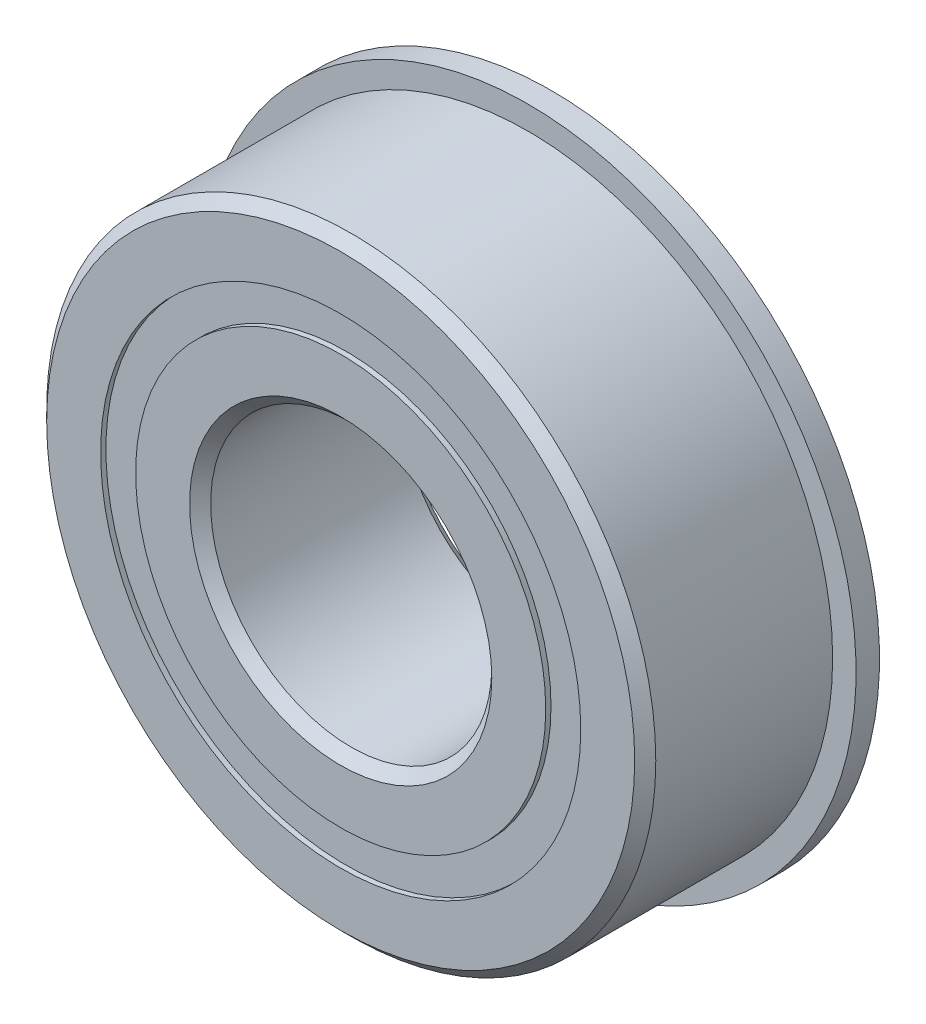
ISO-10303-21;
HEADER;
FILE_DESCRIPTION(('STEP AP214'),'2;1');
FILE_NAME('part.step','',(''),(''),'','','');
FILE_SCHEMA(('AUTOMOTIVE_DESIGN { 1 0 10303 214 1 1 1 1 }'));
ENDSEC;
DATA;
#1=APPLICATION_CONTEXT('core data for automotive mechanical design processes');
#2=APPLICATION_PROTOCOL_DEFINITION('international standard','automotive_design',2000,#1);
#3=PRODUCT_CONTEXT('',#1,'mechanical');
#4=PRODUCT('Part','Part','',(#3));
#5=PRODUCT_RELATED_PRODUCT_CATEGORY('part','',(#4));
#6=PRODUCT_DEFINITION_FORMATION('','',#4);
#7=PRODUCT_DEFINITION_CONTEXT('part definition',#1,'design');
#8=PRODUCT_DEFINITION('design','',#6,#7);
#9=PRODUCT_DEFINITION_SHAPE('','',#8);
#10=(LENGTH_UNIT() NAMED_UNIT(*) SI_UNIT(.MILLI.,.METRE.));
#11=(NAMED_UNIT(*) PLANE_ANGLE_UNIT() SI_UNIT($,.RADIAN.));
#12=(NAMED_UNIT(*) SI_UNIT($,.STERADIAN.) SOLID_ANGLE_UNIT());
#13=UNCERTAINTY_MEASURE_WITH_UNIT(LENGTH_MEASURE(1.E-05),#10,'distance_accuracy_value','');
#14=(GEOMETRIC_REPRESENTATION_CONTEXT(3) GLOBAL_UNCERTAINTY_ASSIGNED_CONTEXT((#13)) GLOBAL_UNIT_ASSIGNED_CONTEXT((#10,
#11,#12)) REPRESENTATION_CONTEXT('',''));
#15=CARTESIAN_POINT('',(0.,0.,0.));
#16=DIRECTION('',(0.,0.,1.));
#17=DIRECTION('',(1.,0.,0.));
#18=AXIS2_PLACEMENT_3D('',#15,#16,#17);
#19=CARTESIAN_POINT('',(0.,16.2675137362637,-6.7865625));
#20=DIRECTION('',(0.,0.,1.));
#21=DIRECTION('',(1.,0.,0.));
#22=AXIS2_PLACEMENT_3D('',#19,#20,#21);
#23=PLANE('',#22);
#24=CARTESIAN_POINT('',(0.,0.,-6.7865625));
#25=DIRECTION('',(0.,0.,1.));
#26=DIRECTION('',(1.,0.,0.));
#27=AXIS2_PLACEMENT_3D('',#24,#25,#26);
#28=CIRCLE('',#27,16.2675137362637);
#29=CARTESIAN_POINT('',(16.2675137362637,0.,-6.7865625));
#30=VERTEX_POINT('',#29);
#31=EDGE_CURVE('E59',#30,#30,#28,.T.);
#32=ORIENTED_EDGE('',*,*,#31,.F.);
#33=EDGE_LOOP('',(#32));
#34=FACE_BOUND('',#33,.T.);
#35=CARTESIAN_POINT('',(0.,0.,-6.7865625));
#36=DIRECTION('',(0.,0.,1.));
#37=DIRECTION('',(1.,0.,0.));
#38=AXIS2_PLACEMENT_3D('',#35,#36,#37);
#39=CIRCLE('',#38,13.8949862637363);
#40=CARTESIAN_POINT('',(13.8949862637363,0.,-6.7865625));
#41=VERTEX_POINT('',#40);
#42=EDGE_CURVE('E11',#41,#41,#39,.T.);
#43=ORIENTED_EDGE('',*,*,#42,.T.);
#44=EDGE_LOOP('',(#43));
#45=FACE_BOUND('',#44,.T.);
#46=ADVANCED_FACE('F45',(#34,#45),#23,.F.);
#47=CARTESIAN_POINT('',(0.,0.,7.14375));
#48=DIRECTION('',(0.,0.,1.));
#49=DIRECTION('',(1.,0.,0.));
#50=AXIS2_PLACEMENT_3D('',#47,#48,#49);
#51=CYLINDRICAL_SURFACE('',#50,13.8949862637363);
#52=ORIENTED_EDGE('',*,*,#42,.F.);
#53=EDGE_LOOP('',(#52));
#54=FACE_BOUND('',#53,.T.);
#55=CARTESIAN_POINT('',(0.,0.,-3.38937260447629));
#56=DIRECTION('',(0.,0.,1.));
#57=DIRECTION('',(1.,0.,0.));
#58=AXIS2_PLACEMENT_3D('',#55,#56,#57);
#59=CIRCLE('',#58,13.8949862637363);
#60=CARTESIAN_POINT('',(13.8949862637363,0.,-3.38937260447629));
#61=VERTEX_POINT('',#60);
#62=EDGE_CURVE('E51',#61,#61,#59,.T.);
#63=ORIENTED_EDGE('',*,*,#62,.T.);
#64=EDGE_LOOP('',(#63));
#65=FACE_BOUND('',#64,.T.);
#66=ADVANCED_FACE('F68',(#54,#65),#51,.F.);
#67=CARTESIAN_POINT('',(0.,16.2675137362637,-3.38937260447629));
#68=DIRECTION('',(0.,0.,-1.));
#69=DIRECTION('',(-1.,0.,0.));
#70=AXIS2_PLACEMENT_3D('',#67,#68,#69);
#71=PLANE('',#70);
#72=ORIENTED_EDGE('',*,*,#62,.F.);
#73=EDGE_LOOP('',(#72));
#74=FACE_BOUND('',#73,.T.);
#75=CARTESIAN_POINT('',(0.,0.,-3.38937260447629));
#76=DIRECTION('',(0.,0.,1.));
#77=DIRECTION('',(1.,0.,0.));
#78=AXIS2_PLACEMENT_3D('',#75,#76,#77);
#79=CIRCLE('',#78,16.2675137362637);
#80=CARTESIAN_POINT('',(16.2675137362637,0.,-3.38937260447629));
#81=VERTEX_POINT('',#80);
#82=EDGE_CURVE('E55',#81,#81,#79,.T.);
#83=ORIENTED_EDGE('',*,*,#82,.T.);
#84=EDGE_LOOP('',(#83));
#85=FACE_BOUND('',#84,.T.);
#86=ADVANCED_FACE('F72',(#74,#85),#71,.F.);
#87=CARTESIAN_POINT('',(0.,0.,7.14375));
#88=DIRECTION('',(0.,0.,1.));
#89=DIRECTION('',(1.,0.,0.));
#90=AXIS2_PLACEMENT_3D('',#87,#88,#89);
#91=CYLINDRICAL_SURFACE('',#90,16.2675137362637);
#92=ORIENTED_EDGE('',*,*,#82,.F.);
#93=EDGE_LOOP('',(#92));
#94=FACE_BOUND('',#93,.T.);
#95=ORIENTED_EDGE('',*,*,#31,.T.);
#96=EDGE_LOOP('',(#95));
#97=FACE_BOUND('',#96,.T.);
#98=ADVANCED_FACE('F65',(#94,#97),#91,.T.);
#99=CLOSED_SHELL('',(#46,#66,#86,#98));
#100=MANIFOLD_SOLID_BREP('B2',#99);
#101=CARTESIAN_POINT('',(0.,16.2675137362637,6.7865625));
#102=DIRECTION('',(0.,0.,-1.));
#103=DIRECTION('',(-1.,0.,0.));
#104=AXIS2_PLACEMENT_3D('',#101,#102,#103);
#105=PLANE('',#104);
#106=CARTESIAN_POINT('',(0.,0.,6.7865625));
#107=DIRECTION('',(0.,0.,1.));
#108=DIRECTION('',(1.,0.,0.));
#109=AXIS2_PLACEMENT_3D('',#106,#107,#108);
#110=CIRCLE('',#109,13.8949862637363);
#111=CARTESIAN_POINT('',(13.8949862637363,0.,6.7865625));
#112=VERTEX_POINT('',#111);
#113=EDGE_CURVE('E44',#112,#112,#110,.T.);
#114=ORIENTED_EDGE('',*,*,#113,.F.);
#115=EDGE_LOOP('',(#114));
#116=FACE_BOUND('',#115,.T.);
#117=CARTESIAN_POINT('',(0.,0.,6.7865625));
#118=DIRECTION('',(0.,0.,1.));
#119=DIRECTION('',(1.,0.,0.));
#120=AXIS2_PLACEMENT_3D('',#117,#118,#119);
#121=CIRCLE('',#120,16.2675137362637);
#122=CARTESIAN_POINT('',(16.2675137362637,0.,6.7865625));
#123=VERTEX_POINT('',#122);
#124=EDGE_CURVE('E126',#123,#123,#121,.T.);
#125=ORIENTED_EDGE('',*,*,#124,.T.);
#126=EDGE_LOOP('',(#125));
#127=FACE_BOUND('',#126,.T.);
#128=ADVANCED_FACE('F112',(#116,#127),#105,.F.);
#129=CARTESIAN_POINT('',(0.,0.,7.14375));
#130=DIRECTION('',(0.,0.,1.));
#131=DIRECTION('',(1.,0.,0.));
#132=AXIS2_PLACEMENT_3D('',#129,#130,#131);
#133=CYLINDRICAL_SURFACE('',#132,13.8949862637363);
#134=CARTESIAN_POINT('',(0.,0.,3.38937260447629));
#135=DIRECTION('',(0.,0.,1.));
#136=DIRECTION('',(1.,0.,0.));
#137=AXIS2_PLACEMENT_3D('',#134,#135,#136);
#138=CIRCLE('',#137,13.8949862637363);
#139=CARTESIAN_POINT('',(13.8949862637363,0.,3.38937260447629));
#140=VERTEX_POINT('',#139);
#141=EDGE_CURVE('E118',#140,#140,#138,.T.);
#142=ORIENTED_EDGE('',*,*,#141,.F.);
#143=EDGE_LOOP('',(#142));
#144=FACE_BOUND('',#143,.T.);
#145=ORIENTED_EDGE('',*,*,#113,.T.);
#146=EDGE_LOOP('',(#145));
#147=FACE_BOUND('',#146,.T.);
#148=ADVANCED_FACE('F141',(#144,#147),#133,.F.);
#149=CARTESIAN_POINT('',(0.,16.2675137362637,3.38937260447629));
#150=DIRECTION('',(0.,0.,1.));
#151=DIRECTION('',(1.,0.,0.));
#152=AXIS2_PLACEMENT_3D('',#149,#150,#151);
#153=PLANE('',#152);
#154=CARTESIAN_POINT('',(0.,0.,3.38937260447629));
#155=DIRECTION('',(0.,0.,1.));
#156=DIRECTION('',(1.,0.,0.));
#157=AXIS2_PLACEMENT_3D('',#154,#155,#156);
#158=CIRCLE('',#157,16.2675137362637);
#159=CARTESIAN_POINT('',(16.2675137362637,0.,3.38937260447629));
#160=VERTEX_POINT('',#159);
#161=EDGE_CURVE('E122',#160,#160,#158,.T.);
#162=ORIENTED_EDGE('',*,*,#161,.F.);
#163=EDGE_LOOP('',(#162));
#164=FACE_BOUND('',#163,.T.);
#165=ORIENTED_EDGE('',*,*,#141,.T.);
#166=EDGE_LOOP('',(#165));
#167=FACE_BOUND('',#166,.T.);
#168=ADVANCED_FACE('F136',(#164,#167),#153,.F.);
#169=CARTESIAN_POINT('',(0.,0.,7.14375));
#170=DIRECTION('',(0.,0.,1.));
#171=DIRECTION('',(1.,0.,0.));
#172=AXIS2_PLACEMENT_3D('',#169,#170,#171);
#173=CYLINDRICAL_SURFACE('',#172,16.2675137362637);
#174=ORIENTED_EDGE('',*,*,#124,.F.);
#175=EDGE_LOOP('',(#174));
#176=FACE_BOUND('',#175,.T.);
#177=ORIENTED_EDGE('',*,*,#161,.T.);
#178=EDGE_LOOP('',(#177));
#179=FACE_BOUND('',#178,.T.);
#180=ADVANCED_FACE('F133',(#176,#179),#173,.T.);
#181=CLOSED_SHELL('',(#128,#148,#168,#180));
#182=MANIFOLD_SOLID_BREP('B6',#181);
#183=CARTESIAN_POINT('',(-6.5435091405665,13.5877367390534,0.));
#184=DIRECTION('',(0.,0.,1.));
#185=DIRECTION('',(-0.433883739117546,0.900968867902425,0.));
#186=AXIS2_PLACEMENT_3D('',#183,#184,#185);
#187=SPHERICAL_SURFACE('',#186,3.38937260447629);
#188=CARTESIAN_POINT('',(-6.5435091405665,13.5877367390534,3.38937260447629));
#189=VERTEX_POINT('',#188);
#190=VERTEX_LOOP('',#189);
#191=FACE_BOUND('',#190,.T.);
#192=ADVANCED_FACE('F179',(#191),#187,.T.);
#193=CLOSED_SHELL('',(#192));
#194=MANIFOLD_SOLID_BREP('B39',#193);
#195=CARTESIAN_POINT('',(-11.7909960449709,9.40300557428217,0.));
#196=DIRECTION('',(0.,0.,1.));
#197=DIRECTION('',(-0.781831482468022,0.623489801858743,0.));
#198=AXIS2_PLACEMENT_3D('',#195,#196,#197);
#199=SPHERICAL_SURFACE('',#198,3.38937260447629);
#200=CARTESIAN_POINT('',(-11.7909960449709,9.40300557428217,3.38937260447629));
#201=VERTEX_POINT('',#200);
#202=VERTEX_LOOP('',#201);
#203=FACE_BOUND('',#202,.T.);
#204=ADVANCED_FACE('F199',(#203),#199,.T.);
#205=CLOSED_SHELL('',(#204));
#206=MANIFOLD_SOLID_BREP('B108',#205);
#207=CARTESIAN_POINT('',(-14.7031315755921,3.35589383522882,0.));
#208=DIRECTION('',(0.,0.,1.));
#209=DIRECTION('',(-0.974927912181821,0.222520933956325,0.));
#210=AXIS2_PLACEMENT_3D('',#207,#208,#209);
#211=SPHERICAL_SURFACE('',#210,3.38937260447629);
#212=CARTESIAN_POINT('',(-14.7031315755921,3.35589383522882,3.38937260447629));
#213=VERTEX_POINT('',#212);
#214=VERTEX_LOOP('',#213);
#215=FACE_BOUND('',#214,.T.);
#216=ADVANCED_FACE('F219',(#215),#211,.T.);
#217=CLOSED_SHELL('',(#216));
#218=MANIFOLD_SOLID_BREP('B175',#217);
#219=CARTESIAN_POINT('',(-14.7031315755922,-3.35589383522853,0.));
#220=DIRECTION('',(0.,0.,1.));
#221=DIRECTION('',(-0.974927912181826,-0.222520933956305,0.));
#222=AXIS2_PLACEMENT_3D('',#219,#220,#221);
#223=SPHERICAL_SURFACE('',#222,3.38937260447629);
#224=CARTESIAN_POINT('',(-14.7031315755922,-3.35589383522853,3.38937260447629));
#225=VERTEX_POINT('',#224);
#226=VERTEX_LOOP('',#225);
#227=FACE_BOUND('',#226,.T.);
#228=ADVANCED_FACE('F239',(#227),#223,.T.);
#229=CLOSED_SHELL('',(#228));
#230=MANIFOLD_SOLID_BREP('B195',#229);
#231=CARTESIAN_POINT('',(-11.7909960449711,-9.40300557428192,0.));
#232=DIRECTION('',(0.,0.,1.));
#233=DIRECTION('',(-0.781831482468035,-0.623489801858727,0.));
#234=AXIS2_PLACEMENT_3D('',#231,#232,#233);
#235=SPHERICAL_SURFACE('',#234,3.38937260447629);
#236=CARTESIAN_POINT('',(-11.7909960449711,-9.40300557428192,3.38937260447629));
#237=VERTEX_POINT('',#236);
#238=VERTEX_LOOP('',#237);
#239=FACE_BOUND('',#238,.T.);
#240=ADVANCED_FACE('F259',(#239),#235,.T.);
#241=CLOSED_SHELL('',(#240));
#242=MANIFOLD_SOLID_BREP('B215',#241);
#243=CARTESIAN_POINT('',(-6.54350914056678,-13.5877367390533,0.));
#244=DIRECTION('',(0.,0.,1.));
#245=DIRECTION('',(-0.433883739117565,-0.900968867902416,0.));
#246=AXIS2_PLACEMENT_3D('',#243,#244,#245);
#247=SPHERICAL_SURFACE('',#246,3.38937260447629);
#248=CARTESIAN_POINT('',(-6.54350914056678,-13.5877367390533,3.38937260447629));
#249=VERTEX_POINT('',#248);
#250=VERTEX_LOOP('',#249);
#251=FACE_BOUND('',#250,.T.);
#252=ADVANCED_FACE('F279',(#251),#247,.T.);
#253=CLOSED_SHELL('',(#252));
#254=MANIFOLD_SOLID_BREP('B235',#253);
#255=CARTESIAN_POINT('',(-1.05311805882856E-13,-15.08125,0.));
#256=DIRECTION('',(0.,0.,1.));
#257=DIRECTION('',(0.,-1.,0.));
#258=AXIS2_PLACEMENT_3D('',#255,#256,#257);
#259=SPHERICAL_SURFACE('',#258,3.38937260447629);
#260=CARTESIAN_POINT('',(-1.05311805882856E-13,-15.08125,3.38937260447629));
#261=VERTEX_POINT('',#260);
#262=VERTEX_LOOP('',#261);
#263=FACE_BOUND('',#262,.T.);
#264=ADVANCED_FACE('F299',(#263),#259,.T.);
#265=CLOSED_SHELL('',(#264));
#266=MANIFOLD_SOLID_BREP('B255',#265);
#267=CARTESIAN_POINT('',(6.54350914056659,-13.5877367390534,0.));
#268=DIRECTION('',(0.,0.,1.));
#269=DIRECTION('',(0.433883739117553,-0.900968867902422,0.));
#270=AXIS2_PLACEMENT_3D('',#267,#268,#269);
#271=SPHERICAL_SURFACE('',#270,3.38937260447629);
#272=CARTESIAN_POINT('',(6.54350914056659,-13.5877367390534,3.38937260447629));
#273=VERTEX_POINT('',#272);
#274=VERTEX_LOOP('',#273);
#275=FACE_BOUND('',#274,.T.);
#276=ADVANCED_FACE('F319',(#275),#271,.T.);
#277=CLOSED_SHELL('',(#276));
#278=MANIFOLD_SOLID_BREP('B275',#277);
#279=CARTESIAN_POINT('',(11.7909960449709,-9.40300557428208,0.));
#280=DIRECTION('',(0.,0.,1.));
#281=DIRECTION('',(0.781831482468027,-0.623489801858737,0.));
#282=AXIS2_PLACEMENT_3D('',#279,#280,#281);
#283=SPHERICAL_SURFACE('',#282,3.38937260447629);
#284=CARTESIAN_POINT('',(11.7909960449709,-9.40300557428208,3.38937260447629));
#285=VERTEX_POINT('',#284);
#286=VERTEX_LOOP('',#285);
#287=FACE_BOUND('',#286,.T.);
#288=ADVANCED_FACE('F339',(#287),#283,.T.);
#289=CLOSED_SHELL('',(#288));
#290=MANIFOLD_SOLID_BREP('B295',#289);
#291=CARTESIAN_POINT('',(14.7031315755921,-3.35589383522872,0.));
#292=DIRECTION('',(0.,0.,1.));
#293=DIRECTION('',(0.974927912181823,-0.222520933956318,0.));
#294=AXIS2_PLACEMENT_3D('',#291,#292,#293);
#295=SPHERICAL_SURFACE('',#294,3.38937260447629);
#296=CARTESIAN_POINT('',(14.7031315755921,-3.35589383522872,3.38937260447629));
#297=VERTEX_POINT('',#296);
#298=VERTEX_LOOP('',#297);
#299=FACE_BOUND('',#298,.T.);
#300=ADVANCED_FACE('F359',(#299),#295,.T.);
#301=CLOSED_SHELL('',(#300));
#302=MANIFOLD_SOLID_BREP('B315',#301);
#303=CARTESIAN_POINT('',(14.7031315755921,3.35589383522862,0.));
#304=DIRECTION('',(0.,0.,1.));
#305=DIRECTION('',(0.974927912181824,0.222520933956311,0.));
#306=AXIS2_PLACEMENT_3D('',#303,#304,#305);
#307=SPHERICAL_SURFACE('',#306,3.38937260447629);
#308=CARTESIAN_POINT('',(14.7031315755921,3.35589383522862,3.38937260447629));
#309=VERTEX_POINT('',#308);
#310=VERTEX_LOOP('',#309);
#311=FACE_BOUND('',#310,.T.);
#312=ADVANCED_FACE('F379',(#311),#307,.T.);
#313=CLOSED_SHELL('',(#312));
#314=MANIFOLD_SOLID_BREP('B335',#313);
#315=CARTESIAN_POINT('',(11.790996044971,9.403005574282,0.));
#316=DIRECTION('',(0.,0.,1.));
#317=DIRECTION('',(0.781831482468031,0.623489801858732,0.));
#318=AXIS2_PLACEMENT_3D('',#315,#316,#317);
#319=SPHERICAL_SURFACE('',#318,3.38937260447629);
#320=CARTESIAN_POINT('',(11.790996044971,9.403005574282,3.38937260447629));
#321=VERTEX_POINT('',#320);
#322=VERTEX_LOOP('',#321);
#323=FACE_BOUND('',#322,.T.);
#324=ADVANCED_FACE('F399',(#323),#319,.T.);
#325=CLOSED_SHELL('',(#324));
#326=MANIFOLD_SOLID_BREP('B355',#325);
#327=CARTESIAN_POINT('',(6.54350914056669,13.5877367390534,0.));
#328=DIRECTION('',(0.,0.,1.));
#329=DIRECTION('',(0.433883739117559,0.900968867902419,0.));
#330=AXIS2_PLACEMENT_3D('',#327,#328,#329);
#331=SPHERICAL_SURFACE('',#330,3.38937260447629);
#332=CARTESIAN_POINT('',(6.54350914056669,13.5877367390534,3.38937260447629));
#333=VERTEX_POINT('',#332);
#334=VERTEX_LOOP('',#333);
#335=FACE_BOUND('',#334,.T.);
#336=ADVANCED_FACE('F419',(#335),#331,.T.);
#337=CLOSED_SHELL('',(#336));
#338=MANIFOLD_SOLID_BREP('B375',#337);
#339=CARTESIAN_POINT('',(0.,15.08125,0.));
#340=DIRECTION('',(0.,0.,1.));
#341=DIRECTION('',(0.,1.,0.));
#342=AXIS2_PLACEMENT_3D('',#339,#340,#341);
#343=SPHERICAL_SURFACE('',#342,3.38937260447629);
#344=CARTESIAN_POINT('',(0.,15.08125,3.38937260447629));
#345=VERTEX_POINT('',#344);
#346=VERTEX_LOOP('',#345);
#347=FACE_BOUND('',#346,.T.);
#348=ADVANCED_FACE('F441',(#347),#343,.T.);
#349=CLOSED_SHELL('',(#348));
#350=MANIFOLD_SOLID_BREP('B395',#349);
#351=CARTESIAN_POINT('',(0.,13.8949862637363,7.14375));
#352=DIRECTION('',(0.,0.,-1.));
#353=DIRECTION('',(-1.,0.,0.));
#354=AXIS2_PLACEMENT_3D('',#351,#352,#353);
#355=PLANE('',#354);
#356=CARTESIAN_POINT('',(0.,0.,7.14375));
#357=DIRECTION('',(0.,0.,1.));
#358=DIRECTION('',(1.,0.,0.));
#359=AXIS2_PLACEMENT_3D('',#356,#357,#358);
#360=CIRCLE('',#359,10.239375);
#361=CARTESIAN_POINT('',(10.239375,0.,7.14375));
#362=VERTEX_POINT('',#361);
#363=EDGE_CURVE('E488',#362,#362,#360,.T.);
#364=ORIENTED_EDGE('',*,*,#363,.F.);
#365=EDGE_LOOP('',(#364));
#366=FACE_BOUND('',#365,.T.);
#367=CARTESIAN_POINT('',(0.,0.,7.14375));
#368=DIRECTION('',(0.,0.,1.));
#369=DIRECTION('',(1.,0.,0.));
#370=AXIS2_PLACEMENT_3D('',#367,#368,#369);
#371=CIRCLE('',#370,13.8949862637363);
#372=CARTESIAN_POINT('',(13.8949862637363,0.,7.14375));
#373=VERTEX_POINT('',#372);
#374=EDGE_CURVE('E440',#373,#373,#371,.T.);
#375=ORIENTED_EDGE('',*,*,#374,.T.);
#376=EDGE_LOOP('',(#375));
#377=FACE_BOUND('',#376,.T.);
#378=ADVANCED_FACE('F460',(#366,#377),#355,.F.);
#379=CARTESIAN_POINT('',(0.,0.,7.14375));
#380=DIRECTION('',(0.,0.,1.));
#381=DIRECTION('',(1.,0.,0.));
#382=AXIS2_PLACEMENT_3D('',#379,#380,#381);
#383=CYLINDRICAL_SURFACE('',#382,13.8949862637363);
#384=ORIENTED_EDGE('',*,*,#374,.F.);
#385=EDGE_LOOP('',(#384));
#386=FACE_BOUND('',#385,.T.);
#387=CARTESIAN_POINT('',(0.,0.,3.175));
#388=DIRECTION('',(0.,0.,1.));
#389=DIRECTION('',(1.,0.,0.));
#390=AXIS2_PLACEMENT_3D('',#387,#388,#389);
#391=CIRCLE('',#390,13.8949862637363);
#392=CARTESIAN_POINT('',(13.8949862637363,0.,3.175));
#393=VERTEX_POINT('',#392);
#394=EDGE_CURVE('E466',#393,#393,#391,.T.);
#395=ORIENTED_EDGE('',*,*,#394,.T.);
#396=EDGE_LOOP('',(#395));
#397=FACE_BOUND('',#396,.T.);
#398=ADVANCED_FACE('F495',(#386,#397),#383,.T.);
#399=CARTESIAN_POINT('',(0.,0.,0.));
#400=DIRECTION('',(0.,0.,1.));
#401=DIRECTION('',(1.,0.,0.));
#402=AXIS2_PLACEMENT_3D('',#399,#400,#401);
#403=TOROIDAL_SURFACE('',#402,15.08125,3.38937260447629);
#404=ORIENTED_EDGE('',*,*,#394,.F.);
#405=EDGE_LOOP('',(#404));
#406=FACE_BOUND('',#405,.T.);
#407=CARTESIAN_POINT('',(0.,0.,-3.175));
#408=DIRECTION('',(0.,0.,1.));
#409=DIRECTION('',(1.,0.,0.));
#410=AXIS2_PLACEMENT_3D('',#407,#408,#409);
#411=CIRCLE('',#410,13.8949862637363);
#412=CARTESIAN_POINT('',(13.8949862637363,0.,-3.175));
#413=VERTEX_POINT('',#412);
#414=EDGE_CURVE('E470',#413,#413,#411,.T.);
#415=ORIENTED_EDGE('',*,*,#414,.T.);
#416=EDGE_LOOP('',(#415));
#417=FACE_BOUND('',#416,.T.);
#418=ADVANCED_FACE('F499',(#406,#417),#403,.F.);
#419=CARTESIAN_POINT('',(0.,0.,7.14375));
#420=DIRECTION('',(0.,0.,1.));
#421=DIRECTION('',(1.,0.,0.));
#422=AXIS2_PLACEMENT_3D('',#419,#420,#421);
#423=CYLINDRICAL_SURFACE('',#422,13.8949862637363);
#424=ORIENTED_EDGE('',*,*,#414,.F.);
#425=EDGE_LOOP('',(#424));
#426=FACE_BOUND('',#425,.T.);
#427=CARTESIAN_POINT('',(0.,0.,-7.14375));
#428=DIRECTION('',(0.,0.,1.));
#429=DIRECTION('',(1.,0.,0.));
#430=AXIS2_PLACEMENT_3D('',#427,#428,#429);
#431=CIRCLE('',#430,13.8949862637363);
#432=CARTESIAN_POINT('',(13.8949862637363,0.,-7.14375));
#433=VERTEX_POINT('',#432);
#434=EDGE_CURVE('E474',#433,#433,#431,.T.);
#435=ORIENTED_EDGE('',*,*,#434,.T.);
#436=EDGE_LOOP('',(#435));
#437=FACE_BOUND('',#436,.T.);
#438=ADVANCED_FACE('F504',(#426,#437),#423,.T.);
#439=CARTESIAN_POINT('',(0.,10.239375,-7.14375));
#440=DIRECTION('',(0.,0.,1.));
#441=DIRECTION('',(1.,0.,0.));
#442=AXIS2_PLACEMENT_3D('',#439,#440,#441);
#443=PLANE('',#442);
#444=ORIENTED_EDGE('',*,*,#434,.F.);
#445=EDGE_LOOP('',(#444));
#446=FACE_BOUND('',#445,.T.);
#447=CARTESIAN_POINT('',(0.,0.,-7.14375));
#448=DIRECTION('',(0.,0.,1.));
#449=DIRECTION('',(1.,0.,0.));
#450=AXIS2_PLACEMENT_3D('',#447,#448,#449);
#451=CIRCLE('',#450,10.239375);
#452=CARTESIAN_POINT('',(10.239375,0.,-7.14375));
#453=VERTEX_POINT('',#452);
#454=EDGE_CURVE('E479',#453,#453,#451,.T.);
#455=ORIENTED_EDGE('',*,*,#454,.T.);
#456=EDGE_LOOP('',(#455));
#457=FACE_BOUND('',#456,.T.);
#458=ADVANCED_FACE('F510',(#446,#457),#443,.F.);
#459=CARTESIAN_POINT('',(0.,0.,-6.429375));
#460=DIRECTION('',(0.,0.,-1.));
#461=DIRECTION('',(-1.,0.,0.));
#462=AXIS2_PLACEMENT_3D('',#459,#460,#461);
#463=CONICAL_SURFACE('',#462,9.525,0.785398163397444);
#464=ORIENTED_EDGE('',*,*,#454,.F.);
#465=EDGE_LOOP('',(#464));
#466=FACE_BOUND('',#465,.T.);
#467=CARTESIAN_POINT('',(0.,0.,-6.429375));
#468=DIRECTION('',(0.,0.,1.));
#469=DIRECTION('',(1.,0.,0.));
#470=AXIS2_PLACEMENT_3D('',#467,#468,#469);
#471=CIRCLE('',#470,9.525);
#472=CARTESIAN_POINT('',(9.525,0.,-6.429375));
#473=VERTEX_POINT('',#472);
#474=EDGE_CURVE('E482',#473,#473,#471,.T.);
#475=ORIENTED_EDGE('',*,*,#474,.T.);
#476=EDGE_LOOP('',(#475));
#477=FACE_BOUND('',#476,.T.);
#478=ADVANCED_FACE('F514',(#466,#477),#463,.F.);
#479=CARTESIAN_POINT('',(0.,0.,7.14375));
#480=DIRECTION('',(0.,0.,1.));
#481=DIRECTION('',(1.,0.,0.));
#482=AXIS2_PLACEMENT_3D('',#479,#480,#481);
#483=CYLINDRICAL_SURFACE('',#482,9.525);
#484=ORIENTED_EDGE('',*,*,#474,.F.);
#485=EDGE_LOOP('',(#484));
#486=FACE_BOUND('',#485,.T.);
#487=CARTESIAN_POINT('',(0.,0.,6.429375));
#488=DIRECTION('',(0.,0.,1.));
#489=DIRECTION('',(1.,0.,0.));
#490=AXIS2_PLACEMENT_3D('',#487,#488,#489);
#491=CIRCLE('',#490,9.525);
#492=CARTESIAN_POINT('',(9.525,0.,6.429375));
#493=VERTEX_POINT('',#492);
#494=EDGE_CURVE('E485',#493,#493,#491,.T.);
#495=ORIENTED_EDGE('',*,*,#494,.T.);
#496=EDGE_LOOP('',(#495));
#497=FACE_BOUND('',#496,.T.);
#498=ADVANCED_FACE('F518',(#486,#497),#483,.F.);
#499=CARTESIAN_POINT('',(0.,0.,7.14375));
#500=DIRECTION('',(0.,0.,1.));
#501=DIRECTION('',(1.,0.,0.));
#502=AXIS2_PLACEMENT_3D('',#499,#500,#501);
#503=CONICAL_SURFACE('',#502,10.239375,0.785398163397453);
#504=ORIENTED_EDGE('',*,*,#494,.F.);
#505=EDGE_LOOP('',(#504));
#506=FACE_BOUND('',#505,.T.);
#507=ORIENTED_EDGE('',*,*,#363,.T.);
#508=EDGE_LOOP('',(#507));
#509=FACE_BOUND('',#508,.T.);
#510=ADVANCED_FACE('F492',(#506,#509),#503,.F.);
#511=CLOSED_SHELL('',(#378,#398,#418,#438,#458,#478,#498,#510));
#512=MANIFOLD_SOLID_BREP('B415',#511);
#513=CARTESIAN_POINT('',(0.,0.,6.429375));
#514=DIRECTION('',(0.,0.,-1.));
#515=DIRECTION('',(-1.,0.,0.));
#516=AXIS2_PLACEMENT_3D('',#513,#514,#515);
#517=CONICAL_SURFACE('',#516,20.6375,0.785398163397446);
#518=CARTESIAN_POINT('',(0.,0.,7.14375));
#519=DIRECTION('',(0.,0.,1.));
#520=DIRECTION('',(1.,0.,0.));
#521=AXIS2_PLACEMENT_3D('',#518,#519,#520);
#522=CIRCLE('',#521,19.923125);
#523=CARTESIAN_POINT('',(19.923125,0.,7.14375));
#524=VERTEX_POINT('',#523);
#525=EDGE_CURVE('E603',#524,#524,#522,.T.);
#526=ORIENTED_EDGE('',*,*,#525,.F.);
#527=EDGE_LOOP('',(#526));
#528=FACE_BOUND('',#527,.T.);
#529=CARTESIAN_POINT('',(0.,0.,6.429375));
#530=DIRECTION('',(0.,0.,1.));
#531=DIRECTION('',(1.,0.,0.));
#532=AXIS2_PLACEMENT_3D('',#529,#530,#531);
#533=CIRCLE('',#532,20.6375);
#534=CARTESIAN_POINT('',(20.6375,0.,6.429375));
#535=VERTEX_POINT('',#534);
#536=EDGE_CURVE('E459',#535,#535,#533,.T.);
#537=ORIENTED_EDGE('',*,*,#536,.T.);
#538=EDGE_LOOP('',(#537));
#539=FACE_BOUND('',#538,.T.);
#540=ADVANCED_FACE('F581',(#528,#539),#517,.T.);
#541=CARTESIAN_POINT('',(0.,0.,7.14375));
#542=DIRECTION('',(0.,0.,1.));
#543=DIRECTION('',(1.,0.,0.));
#544=AXIS2_PLACEMENT_3D('',#541,#542,#543);
#545=CYLINDRICAL_SURFACE('',#544,20.6375);
#546=CARTESIAN_POINT('',(0.,0.,-5.55625));
#547=DIRECTION('',(0.,0.,1.));
#548=DIRECTION('',(1.,0.,0.));
#549=AXIS2_PLACEMENT_3D('',#546,#547,#548);
#550=CIRCLE('',#549,20.6375);
#551=CARTESIAN_POINT('',(20.6375,0.,-5.55625));
#552=VERTEX_POINT('',#551);
#553=EDGE_CURVE('E606',#552,#552,#550,.T.);
#554=ORIENTED_EDGE('',*,*,#553,.T.);
#555=EDGE_LOOP('',(#554));
#556=FACE_BOUND('',#555,.T.);
#557=ORIENTED_EDGE('',*,*,#536,.F.);
#558=EDGE_LOOP('',(#557));
#559=FACE_BOUND('',#558,.T.);
#560=ADVANCED_FACE('F626',(#556,#559),#545,.T.);
#561=CARTESIAN_POINT('',(0.,19.923125,-7.14375));
#562=DIRECTION('',(0.,0.,1.));
#563=DIRECTION('',(1.,0.,0.));
#564=AXIS2_PLACEMENT_3D('',#561,#562,#563);
#565=PLANE('',#564);
#566=CARTESIAN_POINT('',(0.,0.,-7.14375));
#567=DIRECTION('',(0.,0.,1.));
#568=DIRECTION('',(1.,0.,0.));
#569=AXIS2_PLACEMENT_3D('',#566,#567,#568);
#570=CIRCLE('',#569,16.2675137362637);
#571=CARTESIAN_POINT('',(16.2675137362637,0.,-7.14375));
#572=VERTEX_POINT('',#571);
#573=EDGE_CURVE('E587',#572,#572,#570,.T.);
#574=ORIENTED_EDGE('',*,*,#573,.T.);
#575=EDGE_LOOP('',(#574));
#576=FACE_BOUND('',#575,.T.);
#577=CARTESIAN_POINT('',(0.,0.,-7.14375));
#578=DIRECTION('',(0.,0.,-1.));
#579=DIRECTION('',(-1.,0.,0.));
#580=AXIS2_PLACEMENT_3D('',#577,#578,#579);
#581=CIRCLE('',#580,22.225);
#582=CARTESIAN_POINT('',(-22.225,0.,-7.14375));
#583=VERTEX_POINT('',#582);
#584=EDGE_CURVE('E609',#583,#583,#581,.T.);
#585=ORIENTED_EDGE('',*,*,#584,.T.);
#586=EDGE_LOOP('',(#585));
#587=FACE_BOUND('',#586,.T.);
#588=ADVANCED_FACE('F629',(#576,#587),#565,.F.);
#589=CARTESIAN_POINT('',(0.,0.,7.14375));
#590=DIRECTION('',(0.,0.,1.));
#591=DIRECTION('',(1.,0.,0.));
#592=AXIS2_PLACEMENT_3D('',#589,#590,#591);
#593=CYLINDRICAL_SURFACE('',#592,16.2675137362637);
#594=CARTESIAN_POINT('',(0.,0.,-3.175));
#595=DIRECTION('',(0.,0.,1.));
#596=DIRECTION('',(1.,0.,0.));
#597=AXIS2_PLACEMENT_3D('',#594,#595,#596);
#598=CIRCLE('',#597,16.2675137362637);
#599=CARTESIAN_POINT('',(16.2675137362637,0.,-3.175));
#600=VERTEX_POINT('',#599);
#601=EDGE_CURVE('E591',#600,#600,#598,.T.);
#602=ORIENTED_EDGE('',*,*,#601,.T.);
#603=EDGE_LOOP('',(#602));
#604=FACE_BOUND('',#603,.T.);
#605=ORIENTED_EDGE('',*,*,#573,.F.);
#606=EDGE_LOOP('',(#605));
#607=FACE_BOUND('',#606,.T.);
#608=ADVANCED_FACE('F634',(#604,#607),#593,.F.);
#609=CARTESIAN_POINT('',(0.,0.,0.));
#610=DIRECTION('',(0.,0.,1.));
#611=DIRECTION('',(1.,0.,0.));
#612=AXIS2_PLACEMENT_3D('',#609,#610,#611);
#613=TOROIDAL_SURFACE('',#612,15.08125,3.38937260447629);
#614=ORIENTED_EDGE('',*,*,#601,.F.);
#615=EDGE_LOOP('',(#614));
#616=FACE_BOUND('',#615,.T.);
#617=CARTESIAN_POINT('',(0.,0.,3.175));
#618=DIRECTION('',(0.,0.,1.));
#619=DIRECTION('',(1.,0.,0.));
#620=AXIS2_PLACEMENT_3D('',#617,#618,#619);
#621=CIRCLE('',#620,16.2675137362637);
#622=CARTESIAN_POINT('',(16.2675137362637,0.,3.175));
#623=VERTEX_POINT('',#622);
#624=EDGE_CURVE('E595',#623,#623,#621,.T.);
#625=ORIENTED_EDGE('',*,*,#624,.T.);
#626=EDGE_LOOP('',(#625));
#627=FACE_BOUND('',#626,.T.);
#628=ADVANCED_FACE('F640',(#616,#627),#613,.F.);
#629=CARTESIAN_POINT('',(0.,0.,7.14375));
#630=DIRECTION('',(0.,0.,1.));
#631=DIRECTION('',(1.,0.,0.));
#632=AXIS2_PLACEMENT_3D('',#629,#630,#631);
#633=CYLINDRICAL_SURFACE('',#632,16.2675137362637);
#634=ORIENTED_EDGE('',*,*,#624,.F.);
#635=EDGE_LOOP('',(#634));
#636=FACE_BOUND('',#635,.T.);
#637=CARTESIAN_POINT('',(0.,0.,7.14375));
#638=DIRECTION('',(0.,0.,1.));
#639=DIRECTION('',(1.,0.,0.));
#640=AXIS2_PLACEMENT_3D('',#637,#638,#639);
#641=CIRCLE('',#640,16.2675137362637);
#642=CARTESIAN_POINT('',(16.2675137362637,0.,7.14375));
#643=VERTEX_POINT('',#642);
#644=EDGE_CURVE('E600',#643,#643,#641,.T.);
#645=ORIENTED_EDGE('',*,*,#644,.T.);
#646=EDGE_LOOP('',(#645));
#647=FACE_BOUND('',#646,.T.);
#648=ADVANCED_FACE('F644',(#636,#647),#633,.F.);
#649=CARTESIAN_POINT('',(0.,19.923125,7.14375));
#650=DIRECTION('',(0.,0.,-1.));
#651=DIRECTION('',(-1.,0.,0.));
#652=AXIS2_PLACEMENT_3D('',#649,#650,#651);
#653=PLANE('',#652);
#654=ORIENTED_EDGE('',*,*,#644,.F.);
#655=EDGE_LOOP('',(#654));
#656=FACE_BOUND('',#655,.T.);
#657=ORIENTED_EDGE('',*,*,#525,.T.);
#658=EDGE_LOOP('',(#657));
#659=FACE_BOUND('',#658,.T.);
#660=ADVANCED_FACE('F622',(#656,#659),#653,.F.);
#661=CARTESIAN_POINT('',(0.,16.2675137362637,-5.55625));
#662=DIRECTION('',(0.,0.,1.));
#663=DIRECTION('',(1.,0.,0.));
#664=AXIS2_PLACEMENT_3D('',#661,#662,#663);
#665=PLANE('',#664);
#666=CARTESIAN_POINT('',(0.,0.,-5.55625));
#667=DIRECTION('',(0.,0.,-1.));
#668=DIRECTION('',(-1.,0.,0.));
#669=AXIS2_PLACEMENT_3D('',#666,#667,#668);
#670=CIRCLE('',#669,22.225);
#671=CARTESIAN_POINT('',(-22.225,0.,-5.55625));
#672=VERTEX_POINT('',#671);
#673=EDGE_CURVE('E612',#672,#672,#670,.T.);
#674=ORIENTED_EDGE('',*,*,#673,.F.);
#675=EDGE_LOOP('',(#674));
#676=FACE_BOUND('',#675,.T.);
#677=ORIENTED_EDGE('',*,*,#553,.F.);
#678=EDGE_LOOP('',(#677));
#679=FACE_BOUND('',#678,.T.);
#680=ADVANCED_FACE('F619',(#676,#679),#665,.T.);
#681=CARTESIAN_POINT('',(0.,0.,-7.14375));
#682=DIRECTION('',(0.,0.,-1.));
#683=DIRECTION('',(-1.,0.,0.));
#684=AXIS2_PLACEMENT_3D('',#681,#682,#683);
#685=CYLINDRICAL_SURFACE('',#684,22.225);
#686=ORIENTED_EDGE('',*,*,#673,.T.);
#687=EDGE_LOOP('',(#686));
#688=FACE_BOUND('',#687,.T.);
#689=ORIENTED_EDGE('',*,*,#584,.F.);
#690=EDGE_LOOP('',(#689));
#691=FACE_BOUND('',#690,.T.);
#692=ADVANCED_FACE('F616',(#688,#691),#685,.T.);
#693=CLOSED_SHELL('',(#540,#560,#588,#608,#628,#648,#660,#680,#692));
#694=MANIFOLD_SOLID_BREP('B435',#693);
#695=ADVANCED_BREP_SHAPE_REPRESENTATION('',(#18,#100,#182,#194,#206,#218,#230,#242,#254,#266,
#278,#290,#302,#314,#326,#338,#350,#512,#694),#14);
#696=SHAPE_DEFINITION_REPRESENTATION(#9,#695);
ENDSEC;
END-ISO-10303-21;
